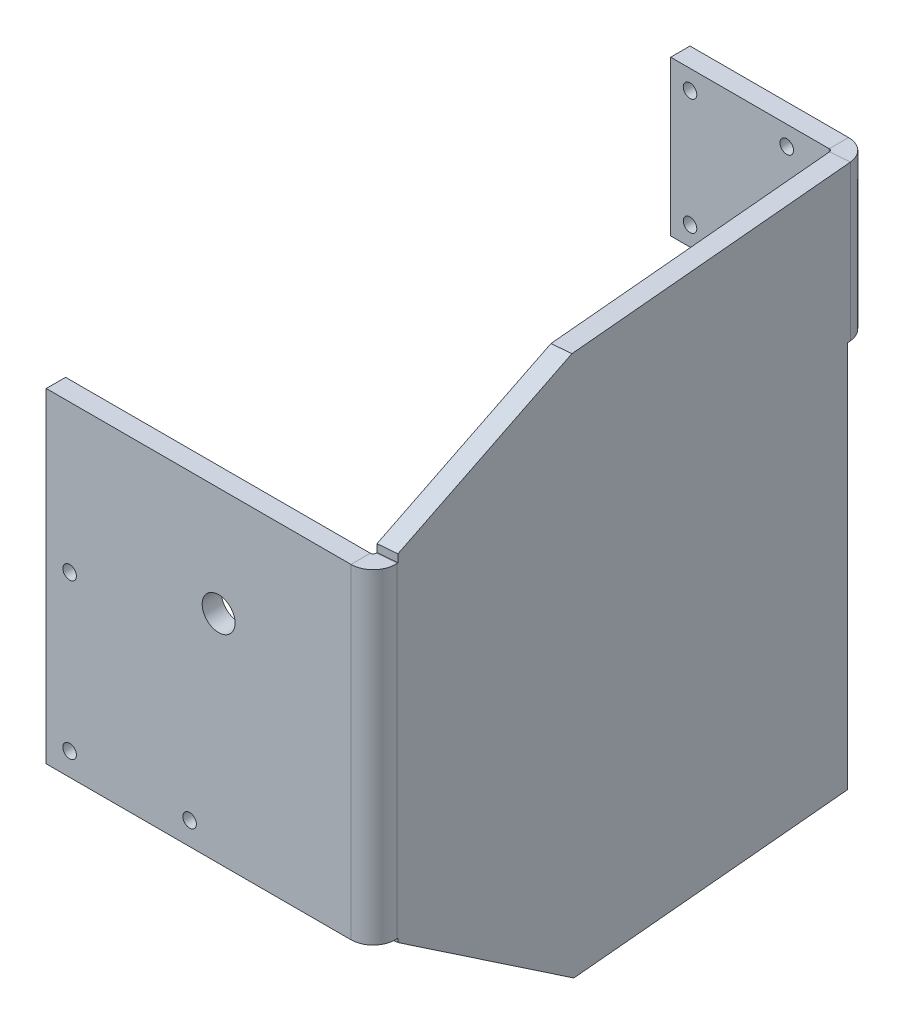
ISO-10303-21;
HEADER;
FILE_DESCRIPTION(('STEP AP214'),'2;1');
FILE_NAME('part.step','',(''),(''),'','','');
FILE_SCHEMA(('AUTOMOTIVE_DESIGN { 1 0 10303 214 1 1 1 1 }'));
ENDSEC;
DATA;
#1=APPLICATION_CONTEXT('core data for automotive mechanical design processes');
#2=APPLICATION_PROTOCOL_DEFINITION('international standard','automotive_design',2000,#1);
#3=PRODUCT_CONTEXT('',#1,'mechanical');
#4=PRODUCT('Part','Part','',(#3));
#5=PRODUCT_RELATED_PRODUCT_CATEGORY('part','',(#4));
#6=PRODUCT_DEFINITION_FORMATION('','',#4);
#7=PRODUCT_DEFINITION_CONTEXT('part definition',#1,'design');
#8=PRODUCT_DEFINITION('design','',#6,#7);
#9=PRODUCT_DEFINITION_SHAPE('','',#8);
#10=(LENGTH_UNIT() NAMED_UNIT(*) SI_UNIT(.MILLI.,.METRE.));
#11=(NAMED_UNIT(*) PLANE_ANGLE_UNIT() SI_UNIT($,.RADIAN.));
#12=(NAMED_UNIT(*) SI_UNIT($,.STERADIAN.) SOLID_ANGLE_UNIT());
#13=UNCERTAINTY_MEASURE_WITH_UNIT(LENGTH_MEASURE(1.E-05),#10,'distance_accuracy_value','');
#14=(GEOMETRIC_REPRESENTATION_CONTEXT(3) GLOBAL_UNCERTAINTY_ASSIGNED_CONTEXT((#13)) GLOBAL_UNIT_ASSIGNED_CONTEXT((#10,
#11,#12)) REPRESENTATION_CONTEXT('',''));
#15=CARTESIAN_POINT('',(0.,0.,0.));
#16=DIRECTION('',(0.,0.,1.));
#17=DIRECTION('',(1.,0.,0.));
#18=AXIS2_PLACEMENT_3D('',#15,#16,#17);
#19=CARTESIAN_POINT('',(56.2588254222091,0.,-5.36112372776498));
#20=DIRECTION('',(-0.996194698091745,0.,0.087155742747662));
#21=DIRECTION('',(0.087155742747662,0.,0.996194698091745));
#22=AXIS2_PLACEMENT_3D('',#19,#20,#21);
#23=PLANE('',#22);
#24=DIRECTION('',(0.087155742747662,0.,0.996194698091745));
#25=VECTOR('',#24,1.);
#26=CARTESIAN_POINT('',(58.4219175106389,140.,19.3631319786752));
#27=LINE('',#26,#25);
#28=CARTESIAN_POINT('',(53.5867336963334,140.,-35.9032719122991));
#29=VERTEX_POINT('',#28);
#30=CARTESIAN_POINT('',(46.6873684412418,140.,-114.763377633847));
#31=VERTEX_POINT('',#30);
#32=EDGE_CURVE('E268',#29,#31,#27,.F.);
#33=ORIENTED_EDGE('',*,*,#32,.F.);
#34=DIRECTION('',(-0.0818996083190929,0.34202014332567,-0.936116806662858));
#35=VECTOR('',#34,1.);
#36=CARTESIAN_POINT('',(53.5867336963334,140.,-35.9032719122991));
#37=LINE('',#36,#35);
#38=CARTESIAN_POINT('',(57.8969855294833,122.,13.3631319786756));
#39=VERTEX_POINT('',#38);
#40=EDGE_CURVE('E100',#29,#39,#37,.F.);
#41=ORIENTED_EDGE('',*,*,#40,.T.);
#42=DIRECTION('',(0.,1.,0.));
#43=VECTOR('',#42,1.);
#44=CARTESIAN_POINT('',(57.8969855294833,0.,13.3631319786756));
#45=LINE('',#44,#43);
#46=CARTESIAN_POINT('',(57.8969855294833,120.,13.3631319786756));
#47=VERTEX_POINT('',#46);
#48=EDGE_CURVE('E519',#47,#39,#45,.T.);
#49=ORIENTED_EDGE('',*,*,#48,.F.);
#50=DIRECTION('',(0.087155742747662,0.,0.996194698091745));
#51=VECTOR('',#50,1.);
#52=CARTESIAN_POINT('',(56.2588254222091,120.,-5.36112372776498));
#53=LINE('',#52,#51);
#54=CARTESIAN_POINT('',(57.914413365736,120.,13.5623330585672));
#55=VERTEX_POINT('',#54);
#56=EDGE_CURVE('E511',#47,#55,#53,.T.);
#57=ORIENTED_EDGE('',*,*,#56,.T.);
#58=DIRECTION('',(0.,1.,0.));
#59=VECTOR('',#58,1.);
#60=CARTESIAN_POINT('',(57.914413365736,140.,13.5623330585672));
#61=LINE('',#60,#59);
#62=CARTESIAN_POINT('',(57.914413365736,36.,13.5623330585673));
#63=VERTEX_POINT('',#62);
#64=EDGE_CURVE('E262',#55,#63,#61,.F.);
#65=ORIENTED_EDGE('',*,*,#64,.T.);
#66=DIRECTION('',(0.087155742747662,0.,0.996194698091745));
#67=VECTOR('',#66,1.);
#68=CARTESIAN_POINT('',(56.2588254222091,36.,-5.36112372776498));
#69=LINE('',#68,#67);
#70=CARTESIAN_POINT('',(57.8969855294833,36.,13.3631319786756));
#71=VERTEX_POINT('',#70);
#72=EDGE_CURVE('E484',#63,#71,#69,.F.);
#73=ORIENTED_EDGE('',*,*,#72,.T.);
#74=DIRECTION('',(0.,1.,0.));
#75=VECTOR('',#74,1.);
#76=CARTESIAN_POINT('',(57.8969855294833,0.,13.3631319786756));
#77=LINE('',#76,#75);
#78=CARTESIAN_POINT('',(57.8969855294833,35.0103769104855,13.3631319786756));
#79=VERTEX_POINT('',#78);
#80=EDGE_CURVE('E488',#71,#79,#77,.F.);
#81=ORIENTED_EDGE('',*,*,#80,.T.);
#82=DIRECTION('',(-0.0713938048432728,-0.573576436351044,-0.816034923451709));
#83=VECTOR('',#82,1.);
#84=CARTESIAN_POINT('',(57.8969855294833,35.0103769104855,13.3631319786756));
#85=LINE('',#84,#83);
#86=CARTESIAN_POINT('',(53.5391983921002,0.,-36.446602925912));
#87=VERTEX_POINT('',#86);
#88=EDGE_CURVE('E333',#79,#87,#85,.T.);
#89=ORIENTED_EDGE('',*,*,#88,.T.);
#90=DIRECTION('',(-0.087155742747662,0.,-0.996194698091745));
#91=VECTOR('',#90,1.);
#92=CARTESIAN_POINT('',(46.6285409694087,0.,-115.435778713739));
#93=LINE('',#92,#91);
#94=CARTESIAN_POINT('',(46.7541553301926,0.,-114.));
#95=VERTEX_POINT('',#94);
#96=EDGE_CURVE('E271',#95,#87,#93,.F.);
#97=ORIENTED_EDGE('',*,*,#96,.F.);
#98=DIRECTION('',(0.,1.,0.));
#99=VECTOR('',#98,1.);
#100=CARTESIAN_POINT('',(46.7541553301926,49.9999999999989,-114.));
#101=LINE('',#100,#99);
#102=CARTESIAN_POINT('',(46.7541553301926,99.9999999999978,-114.));
#103=VERTEX_POINT('',#102);
#104=EDGE_CURVE('E459',#103,#95,#101,.F.);
#105=ORIENTED_EDGE('',*,*,#104,.F.);
#106=DIRECTION('',(-0.087155742747662,0.,-0.996194698091745));
#107=VECTOR('',#106,1.);
#108=CARTESIAN_POINT('',(46.7207618857172,99.9999999999978,-114.381688816924));
#109=LINE('',#108,#107);
#110=CARTESIAN_POINT('',(46.6873684412418,99.9999999999978,-114.763377633847));
#111=VERTEX_POINT('',#110);
#112=EDGE_CURVE('E353',#111,#103,#109,.F.);
#113=ORIENTED_EDGE('',*,*,#112,.F.);
#114=DIRECTION('',(0.,1.,0.));
#115=VECTOR('',#114,1.);
#116=CARTESIAN_POINT('',(46.6873684412418,0.,-114.763377633847));
#117=LINE('',#116,#115);
#118=EDGE_CURVE('E279',#31,#111,#117,.F.);
#119=ORIENTED_EDGE('',*,*,#118,.F.);
#120=EDGE_LOOP('',(#33,#41,#49,#57,#65,#73,#81,#89,#97,#105,#113,#119));
#121=FACE_BOUND('',#120,.T.);
#122=ADVANCED_FACE('F78',(#121),#23,.F.);
#123=CARTESIAN_POINT('',(51.2778519317504,0.,-4.92534501402667));
#124=DIRECTION('',(-0.996194698091745,0.,0.087155742747662));
#125=DIRECTION('',(0.087155742747662,0.,0.996194698091745));
#126=AXIS2_PLACEMENT_3D('',#123,#124,#125);
#127=PLANE('',#126);
#128=DIRECTION('',(0.,1.,0.));
#129=VECTOR('',#128,1.);
#130=CARTESIAN_POINT('',(52.9160120390246,0.,13.7989106924139));
#131=LINE('',#130,#129);
#132=CARTESIAN_POINT('',(52.9160120390246,120.,13.7989106924134));
#133=VERTEX_POINT('',#132);
#134=CARTESIAN_POINT('',(52.9160120390246,122.,13.7989106924139));
#135=VERTEX_POINT('',#134);
#136=EDGE_CURVE('E374',#133,#135,#131,.T.);
#137=ORIENTED_EDGE('',*,*,#136,.T.);
#138=DIRECTION('',(0.0818996083190929,-0.34202014332567,0.936116806662858));
#139=VECTOR('',#138,1.);
#140=CARTESIAN_POINT('',(54.8868607864539,113.769558061344,36.3258149563615));
#141=LINE('',#140,#139);
#142=CARTESIAN_POINT('',(48.6057602058747,140.,-35.4674931985608));
#143=VERTEX_POINT('',#142);
#144=EDGE_CURVE('E13',#135,#143,#141,.F.);
#145=ORIENTED_EDGE('',*,*,#144,.T.);
#146=DIRECTION('',(-0.087155742747662,0.,-0.996194698091745));
#147=VECTOR('',#146,1.);
#148=CARTESIAN_POINT('',(51.2778519317504,140.,-4.9253450140267));
#149=LINE('',#148,#147);
#150=CARTESIAN_POINT('',(41.7063949507831,140.,-114.327598920108));
#151=VERTEX_POINT('',#150);
#152=EDGE_CURVE('E274',#143,#151,#149,.T.);
#153=ORIENTED_EDGE('',*,*,#152,.T.);
#154=DIRECTION('',(0.,1.,0.));
#155=VECTOR('',#154,1.);
#156=CARTESIAN_POINT('',(41.7063949507831,0.,-114.327598920108));
#157=LINE('',#156,#155);
#158=CARTESIAN_POINT('',(41.7063949507831,99.9999999999978,-114.327598920108));
#159=VERTEX_POINT('',#158);
#160=EDGE_CURVE('E264',#159,#151,#157,.T.);
#161=ORIENTED_EDGE('',*,*,#160,.F.);
#162=DIRECTION('',(0.087155742747662,0.,0.996194698091745));
#163=VECTOR('',#162,1.);
#164=CARTESIAN_POINT('',(51.2778519317504,99.9999999999978,-4.92534501402667));
#165=LINE('',#164,#163);
#166=CARTESIAN_POINT('',(41.7731818397339,99.9999999999978,-113.564221286262));
#167=VERTEX_POINT('',#166);
#168=EDGE_CURVE('E372',#159,#167,#165,.T.);
#169=ORIENTED_EDGE('',*,*,#168,.T.);
#170=DIRECTION('',(0.,-1.,0.));
#171=VECTOR('',#170,1.);
#172=CARTESIAN_POINT('',(41.7731818397339,0.,-113.564221286262));
#173=LINE('',#172,#171);
#174=CARTESIAN_POINT('',(41.7731818397339,0.,-113.564221286262));
#175=VERTEX_POINT('',#174);
#176=EDGE_CURVE('E458',#167,#175,#173,.T.);
#177=ORIENTED_EDGE('',*,*,#176,.T.);
#178=DIRECTION('',(0.087155742747662,0.,0.996194698091745));
#179=VECTOR('',#178,1.);
#180=CARTESIAN_POINT('',(51.2778519317504,0.,-4.92534501402667));
#181=LINE('',#180,#179);
#182=CARTESIAN_POINT('',(48.5582249016415,0.,-36.0108242121737));
#183=VERTEX_POINT('',#182);
#184=EDGE_CURVE('E276',#175,#183,#181,.T.);
#185=ORIENTED_EDGE('',*,*,#184,.T.);
#186=DIRECTION('',(0.0713938048432728,0.573576436351044,0.816034923451709));
#187=VECTOR('',#186,1.);
#188=CARTESIAN_POINT('',(50.3831220300111,14.661187954547,-15.1521545877514));
#189=LINE('',#188,#187);
#190=CARTESIAN_POINT('',(52.9160120390246,35.0103769104855,13.7989106924139));
#191=VERTEX_POINT('',#190);
#192=EDGE_CURVE('E337',#183,#191,#189,.T.);
#193=ORIENTED_EDGE('',*,*,#192,.T.);
#194=DIRECTION('',(0.,-1.,0.));
#195=VECTOR('',#194,1.);
#196=CARTESIAN_POINT('',(52.9160120390246,0.,13.7989106924139));
#197=LINE('',#196,#195);
#198=CARTESIAN_POINT('',(52.9160120390246,36.,13.7989106924139));
#199=VERTEX_POINT('',#198);
#200=EDGE_CURVE('E477',#199,#191,#197,.T.);
#201=ORIENTED_EDGE('',*,*,#200,.F.);
#202=DIRECTION('',(-0.087155742747662,0.,-0.996194698091745));
#203=VECTOR('',#202,1.);
#204=CARTESIAN_POINT('',(51.2778519317504,36.,-4.92534501402667));
#205=LINE('',#204,#203);
#206=CARTESIAN_POINT('',(52.9334398752773,36.,13.9981117723056));
#207=VERTEX_POINT('',#206);
#208=EDGE_CURVE('E485',#207,#199,#205,.T.);
#209=ORIENTED_EDGE('',*,*,#208,.F.);
#210=DIRECTION('',(0.,1.,0.));
#211=VECTOR('',#210,1.);
#212=CARTESIAN_POINT('',(52.9334398752773,140.,13.9981117723056));
#213=LINE('',#212,#211);
#214=CARTESIAN_POINT('',(52.9334398752773,120.,13.9981117723056));
#215=VERTEX_POINT('',#214);
#216=EDGE_CURVE('E265',#215,#207,#213,.F.);
#217=ORIENTED_EDGE('',*,*,#216,.F.);
#218=DIRECTION('',(0.087155742747662,0.,0.996194698091745));
#219=VECTOR('',#218,1.);
#220=CARTESIAN_POINT('',(51.2778519317504,120.,-4.92534501402667));
#221=LINE('',#220,#219);
#222=EDGE_CURVE('E516',#133,#215,#221,.T.);
#223=ORIENTED_EDGE('',*,*,#222,.F.);
#224=EDGE_LOOP('',(#137,#145,#153,#161,#169,#177,#185,#193,#201,#209,#217,#223));
#225=FACE_BOUND('',#224,.T.);
#226=ADVANCED_FACE('F370',(#225),#127,.T.);
#227=CARTESIAN_POINT('',(46.6285409694087,0.,-115.435778713739));
#228=DIRECTION('',(0.,-1.,0.));
#229=DIRECTION('',(1.,0.,0.));
#230=AXIS2_PLACEMENT_3D('',#227,#228,#229);
#231=PLANE('',#230);
#232=ORIENTED_EDGE('',*,*,#96,.T.);
#233=DIRECTION('',(-0.996194698091745,0.,0.087155742747662));
#234=VECTOR('',#233,1.);
#235=CARTESIAN_POINT('',(53.5391983921002,0.,-36.446602925912));
#236=LINE('',#235,#234);
#237=EDGE_CURVE('E335',#87,#183,#236,.T.);
#238=ORIENTED_EDGE('',*,*,#237,.T.);
#239=ORIENTED_EDGE('',*,*,#184,.F.);
#240=DIRECTION('',(0.996194698091745,0.,-0.087155742747662));
#241=VECTOR('',#240,1.);
#242=CARTESIAN_POINT('',(41.7731818397339,0.,-113.564221286262));
#243=LINE('',#242,#241);
#244=EDGE_CURVE('E461',#95,#175,#243,.F.);
#245=ORIENTED_EDGE('',*,*,#244,.F.);
#246=EDGE_LOOP('',(#232,#238,#239,#245));
#247=FACE_BOUND('',#246,.T.);
#248=ADVANCED_FACE('F387',(#247),#231,.T.);
#249=CARTESIAN_POINT('',(58.4219175106388,140.,19.3631319786752));
#250=DIRECTION('',(0.,1.,0.));
#251=DIRECTION('',(0.,0.,1.));
#252=AXIS2_PLACEMENT_3D('',#249,#250,#251);
#253=PLANE('',#252);
#254=ORIENTED_EDGE('',*,*,#152,.F.);
#255=DIRECTION('',(0.996194698091745,0.,-0.087155742747662));
#256=VECTOR('',#255,1.);
#257=CARTESIAN_POINT('',(53.5867336963334,140.,-35.9032719122991));
#258=LINE('',#257,#256);
#259=EDGE_CURVE('E339',#143,#29,#258,.T.);
#260=ORIENTED_EDGE('',*,*,#259,.T.);
#261=ORIENTED_EDGE('',*,*,#32,.T.);
#262=DIRECTION('',(0.996194698091745,0.,-0.087155742747662));
#263=VECTOR('',#262,1.);
#264=CARTESIAN_POINT('',(41.7063949507831,140.,-114.327598920108));
#265=LINE('',#264,#263);
#266=EDGE_CURVE('E282',#151,#31,#265,.T.);
#267=ORIENTED_EDGE('',*,*,#266,.F.);
#268=EDGE_LOOP('',(#254,#260,#261,#267));
#269=FACE_BOUND('',#268,.T.);
#270=ADVANCED_FACE('F345',(#269),#253,.T.);
#271=CARTESIAN_POINT('',(52.1996428606629,140.,14.0623106924135));
#272=DIRECTION('',(0.,1.,0.));
#273=DIRECTION('',(0.,0.,1.));
#274=AXIS2_PLACEMENT_3D('',#271,#272,#273);
#275=CYLINDRICAL_SURFACE('',#274,5.7366);
#276=ORIENTED_EDGE('',*,*,#64,.F.);
#277=CARTESIAN_POINT('',(52.1996428606629,120.,14.0623106924135));
#278=DIRECTION('',(0.,1.,0.));
#279=DIRECTION('',(0.,0.,1.));
#280=AXIS2_PLACEMENT_3D('',#277,#278,#279);
#281=CIRCLE('',#280,5.7366);
#282=CARTESIAN_POINT('',(52.1996428606629,120.,19.7989106924139));
#283=VERTEX_POINT('',#282);
#284=EDGE_CURVE('E251',#283,#55,#281,.T.);
#285=ORIENTED_EDGE('',*,*,#284,.F.);
#286=DIRECTION('',(0.,1.,0.));
#287=VECTOR('',#286,1.);
#288=CARTESIAN_POINT('',(52.1996428606629,0.,19.7989106924135));
#289=LINE('',#288,#287);
#290=CARTESIAN_POINT('',(52.1996428606629,36.,19.7989106924135));
#291=VERTEX_POINT('',#290);
#292=EDGE_CURVE('E243',#283,#291,#289,.F.);
#293=ORIENTED_EDGE('',*,*,#292,.T.);
#294=CARTESIAN_POINT('',(52.1996428606629,36.,14.0623106924135));
#295=DIRECTION('',(0.,1.,0.));
#296=DIRECTION('',(0.,0.,1.));
#297=AXIS2_PLACEMENT_3D('',#294,#295,#296);
#298=CIRCLE('',#297,5.7366);
#299=EDGE_CURVE('E216',#63,#291,#298,.F.);
#300=ORIENTED_EDGE('',*,*,#299,.F.);
#301=EDGE_LOOP('',(#276,#285,#293,#300));
#302=FACE_BOUND('',#301,.T.);
#303=ADVANCED_FACE('F249',(#302),#275,.T.);
#304=CARTESIAN_POINT('',(52.1996428606629,140.,14.0623106924135));
#305=DIRECTION('',(0.,1.,0.));
#306=DIRECTION('',(0.,0.,1.));
#307=AXIS2_PLACEMENT_3D('',#304,#305,#306);
#308=CYLINDRICAL_SURFACE('',#307,0.736600000000002);
#309=CARTESIAN_POINT('',(52.1996428606629,120.,14.0623106924135));
#310=DIRECTION('',(0.,1.,0.));
#311=DIRECTION('',(0.,0.,1.));
#312=AXIS2_PLACEMENT_3D('',#309,#310,#311);
#313=CIRCLE('',#312,0.736600000000001);
#314=CARTESIAN_POINT('',(52.1996428606629,120.,14.7989106924135));
#315=VERTEX_POINT('',#314);
#316=EDGE_CURVE('E505',#315,#215,#313,.T.);
#317=ORIENTED_EDGE('',*,*,#316,.T.);
#318=ORIENTED_EDGE('',*,*,#216,.T.);
#319=CARTESIAN_POINT('',(52.1996428606629,36.,14.0623106924135));
#320=DIRECTION('',(0.,-1.,0.));
#321=DIRECTION('',(0.,0.,-1.));
#322=AXIS2_PLACEMENT_3D('',#319,#320,#321);
#323=CIRCLE('',#322,0.736600000000001);
#324=CARTESIAN_POINT('',(52.1996428606629,36.,14.7989106924135));
#325=VERTEX_POINT('',#324);
#326=EDGE_CURVE('E236',#207,#325,#323,.T.);
#327=ORIENTED_EDGE('',*,*,#326,.T.);
#328=DIRECTION('',(0.,1.,0.));
#329=VECTOR('',#328,1.);
#330=CARTESIAN_POINT('',(52.1996428606629,0.,14.7989106924135));
#331=LINE('',#330,#329);
#332=EDGE_CURVE('E253',#325,#315,#331,.T.);
#333=ORIENTED_EDGE('',*,*,#332,.T.);
#334=EDGE_LOOP('',(#317,#318,#327,#333));
#335=FACE_BOUND('',#334,.T.);
#336=ADVANCED_FACE('F390',(#335),#308,.F.);
#337=CARTESIAN_POINT('',(-0.437443317629461,0.,19.7989106924139));
#338=DIRECTION('',(0.,0.,-1.));
#339=DIRECTION('',(-1.,0.,0.));
#340=AXIS2_PLACEMENT_3D('',#337,#338,#339);
#341=PLANE('',#340);
#342=CARTESIAN_POINT('',(18.0000197549396,91.8937258404988,19.7989106924137));
#343=DIRECTION('',(0.,0.,-1.));
#344=DIRECTION('',(-1.,0.,0.));
#345=AXIS2_PLACEMENT_3D('',#342,#343,#344);
#346=CIRCLE('',#345,4.25);
#347=CARTESIAN_POINT('',(13.7500197549396,91.8937258404988,19.7989106924138));
#348=VERTEX_POINT('',#347);
#349=EDGE_CURVE('E330',#348,#348,#346,.T.);
#350=ORIENTED_EDGE('',*,*,#349,.T.);
#351=EDGE_LOOP('',(#350));
#352=FACE_BOUND('',#351,.T.);
#353=CARTESIAN_POINT('',(-20.4999682175418,81.8944342916237,19.798910692414));
#354=DIRECTION('',(0.,0.,-1.));
#355=DIRECTION('',(-1.,0.,0.));
#356=AXIS2_PLACEMENT_3D('',#353,#354,#355);
#357=CIRCLE('',#356,1.75);
#358=CARTESIAN_POINT('',(-22.2499682175418,81.8944342916237,19.798910692414));
#359=VERTEX_POINT('',#358);
#360=EDGE_CURVE('E326',#359,#359,#357,.T.);
#361=ORIENTED_EDGE('',*,*,#360,.T.);
#362=EDGE_LOOP('',(#361));
#363=FACE_BOUND('',#362,.T.);
#364=CARTESIAN_POINT('',(10.5000087800418,41.8964274868236,19.7989106924138));
#365=DIRECTION('',(0.,0.,-1.));
#366=DIRECTION('',(-1.,0.,0.));
#367=AXIS2_PLACEMENT_3D('',#364,#365,#366);
#368=CIRCLE('',#367,1.75);
#369=CARTESIAN_POINT('',(8.75000878004175,41.8964274868236,19.7989106924138));
#370=VERTEX_POINT('',#369);
#371=EDGE_CURVE('E322',#370,#370,#368,.T.);
#372=ORIENTED_EDGE('',*,*,#371,.T.);
#373=EDGE_LOOP('',(#372));
#374=FACE_BOUND('',#373,.T.);
#375=CARTESIAN_POINT('',(-20.4999722566747,41.8964342916236,19.798910692414));
#376=DIRECTION('',(0.,0.,-1.));
#377=DIRECTION('',(-1.,0.,0.));
#378=AXIS2_PLACEMENT_3D('',#375,#376,#377);
#379=CIRCLE('',#378,1.75);
#380=CARTESIAN_POINT('',(-22.2499722566747,41.8964342916236,19.798910692414));
#381=VERTEX_POINT('',#380);
#382=EDGE_CURVE('E317',#381,#381,#379,.T.);
#383=ORIENTED_EDGE('',*,*,#382,.T.);
#384=EDGE_LOOP('',(#383));
#385=FACE_BOUND('',#384,.T.);
#386=DIRECTION('',(1.,0.,0.));
#387=VECTOR('',#386,1.);
#388=CARTESIAN_POINT('',(-26.5399567921031,120.,19.7989106924139));
#389=LINE('',#388,#387);
#390=CARTESIAN_POINT('',(-26.5399567921031,120.,19.7989106924141));
#391=VERTEX_POINT('',#390);
#392=EDGE_CURVE('E499',#391,#283,#389,.T.);
#393=ORIENTED_EDGE('',*,*,#392,.F.);
#394=DIRECTION('',(0.,-1.,0.));
#395=VECTOR('',#394,1.);
#396=CARTESIAN_POINT('',(-26.5399567921031,0.,19.7989106924141));
#397=LINE('',#396,#395);
#398=CARTESIAN_POINT('',(-26.5399567921031,36.,19.7989106924141));
#399=VERTEX_POINT('',#398);
#400=EDGE_CURVE('E245',#391,#399,#397,.T.);
#401=ORIENTED_EDGE('',*,*,#400,.T.);
#402=DIRECTION('',(1.,0.,0.));
#403=VECTOR('',#402,1.);
#404=CARTESIAN_POINT('',(-0.437443317629463,36.,19.7989106924139));
#405=LINE('',#404,#403);
#406=EDGE_CURVE('E231',#399,#291,#405,.T.);
#407=ORIENTED_EDGE('',*,*,#406,.T.);
#408=ORIENTED_EDGE('',*,*,#292,.F.);
#409=EDGE_LOOP('',(#393,#401,#407,#408));
#410=FACE_BOUND('',#409,.T.);
#411=ADVANCED_FACE('F242',(#352,#363,#374,#385,#410),#341,.F.);
#412=CARTESIAN_POINT('',(-0.437443317629497,0.,14.7989106924139));
#413=DIRECTION('',(0.,0.,-1.));
#414=DIRECTION('',(-1.,0.,0.));
#415=AXIS2_PLACEMENT_3D('',#412,#413,#414);
#416=PLANE('',#415);
#417=CARTESIAN_POINT('',(18.0000197549396,91.8937258404988,14.7989106924137));
#418=DIRECTION('',(0.,0.,-1.));
#419=DIRECTION('',(-1.,0.,0.));
#420=AXIS2_PLACEMENT_3D('',#417,#418,#419);
#421=CIRCLE('',#420,4.25);
#422=CARTESIAN_POINT('',(13.7500197549396,91.8937258404988,14.7989106924138));
#423=VERTEX_POINT('',#422);
#424=EDGE_CURVE('E327',#423,#423,#421,.T.);
#425=ORIENTED_EDGE('',*,*,#424,.F.);
#426=EDGE_LOOP('',(#425));
#427=FACE_BOUND('',#426,.T.);
#428=CARTESIAN_POINT('',(-20.4999682175418,81.8944342916237,14.798910692414));
#429=DIRECTION('',(0.,0.,-1.));
#430=DIRECTION('',(-1.,0.,0.));
#431=AXIS2_PLACEMENT_3D('',#428,#429,#430);
#432=CIRCLE('',#431,1.75);
#433=CARTESIAN_POINT('',(-22.2499682175418,81.8944342916237,14.798910692414));
#434=VERTEX_POINT('',#433);
#435=EDGE_CURVE('E323',#434,#434,#432,.T.);
#436=ORIENTED_EDGE('',*,*,#435,.F.);
#437=EDGE_LOOP('',(#436));
#438=FACE_BOUND('',#437,.T.);
#439=CARTESIAN_POINT('',(10.5000087800418,41.8964274868236,14.7989106924138));
#440=DIRECTION('',(0.,0.,-1.));
#441=DIRECTION('',(-1.,0.,0.));
#442=AXIS2_PLACEMENT_3D('',#439,#440,#441);
#443=CIRCLE('',#442,1.75);
#444=CARTESIAN_POINT('',(8.75000878004175,41.8964274868236,14.7989106924138));
#445=VERTEX_POINT('',#444);
#446=EDGE_CURVE('E319',#445,#445,#443,.T.);
#447=ORIENTED_EDGE('',*,*,#446,.F.);
#448=EDGE_LOOP('',(#447));
#449=FACE_BOUND('',#448,.T.);
#450=CARTESIAN_POINT('',(-20.4999722566747,41.8964342916236,14.798910692414));
#451=DIRECTION('',(0.,0.,-1.));
#452=DIRECTION('',(-1.,0.,0.));
#453=AXIS2_PLACEMENT_3D('',#450,#451,#452);
#454=CIRCLE('',#453,1.75);
#455=CARTESIAN_POINT('',(-22.2499722566747,41.8964342916236,14.798910692414));
#456=VERTEX_POINT('',#455);
#457=EDGE_CURVE('E314',#456,#456,#454,.T.);
#458=ORIENTED_EDGE('',*,*,#457,.F.);
#459=EDGE_LOOP('',(#458));
#460=FACE_BOUND('',#459,.T.);
#461=DIRECTION('',(0.,1.,0.));
#462=VECTOR('',#461,1.);
#463=CARTESIAN_POINT('',(-26.5399567921032,0.,14.7989106924141));
#464=LINE('',#463,#462);
#465=CARTESIAN_POINT('',(-26.5399567921032,120.,14.7989106924141));
#466=VERTEX_POINT('',#465);
#467=CARTESIAN_POINT('',(-26.5399567921032,36.,14.7989106924141));
#468=VERTEX_POINT('',#467);
#469=EDGE_CURVE('E252',#466,#468,#464,.F.);
#470=ORIENTED_EDGE('',*,*,#469,.F.);
#471=DIRECTION('',(-1.,0.,0.));
#472=VECTOR('',#471,1.);
#473=CARTESIAN_POINT('',(-0.437443317629488,120.,14.7989106924139));
#474=LINE('',#473,#472);
#475=EDGE_CURVE('E496',#466,#315,#474,.F.);
#476=ORIENTED_EDGE('',*,*,#475,.T.);
#477=ORIENTED_EDGE('',*,*,#332,.F.);
#478=DIRECTION('',(-1.,0.,0.));
#479=VECTOR('',#478,1.);
#480=CARTESIAN_POINT('',(12.8298430342799,36.,14.7989106924138));
#481=LINE('',#480,#479);
#482=EDGE_CURVE('E234',#468,#325,#481,.F.);
#483=ORIENTED_EDGE('',*,*,#482,.F.);
#484=EDGE_LOOP('',(#470,#476,#477,#483));
#485=FACE_BOUND('',#484,.T.);
#486=ADVANCED_FACE('F626',(#427,#438,#449,#460,#485),#416,.T.);
#487=CARTESIAN_POINT('',(-26.5399567921031,0.,19.7989106924141));
#488=DIRECTION('',(1.,0.,0.));
#489=DIRECTION('',(0.,0.,-1.));
#490=AXIS2_PLACEMENT_3D('',#487,#488,#489);
#491=PLANE('',#490);
#492=DIRECTION('',(0.,0.,1.));
#493=VECTOR('',#492,1.);
#494=CARTESIAN_POINT('',(-26.5399567921031,120.,19.7989106924141));
#495=LINE('',#494,#493);
#496=EDGE_CURVE('E502',#391,#466,#495,.F.);
#497=ORIENTED_EDGE('',*,*,#496,.T.);
#498=ORIENTED_EDGE('',*,*,#469,.T.);
#499=DIRECTION('',(0.,0.,-1.));
#500=VECTOR('',#499,1.);
#501=CARTESIAN_POINT('',(-26.5399567921031,36.,19.7989106924141));
#502=LINE('',#501,#500);
#503=EDGE_CURVE('E246',#468,#399,#502,.F.);
#504=ORIENTED_EDGE('',*,*,#503,.T.);
#505=ORIENTED_EDGE('',*,*,#400,.F.);
#506=EDGE_LOOP('',(#497,#498,#504,#505));
#507=FACE_BOUND('',#506,.T.);
#508=ADVANCED_FACE('F411',(#507),#491,.F.);
#509=CARTESIAN_POINT('',(0.,0.,-115.));
#510=DIRECTION('',(0.,0.,1.));
#511=DIRECTION('',(1.,0.,0.));
#512=AXIS2_PLACEMENT_3D('',#509,#510,#511);
#513=PLANE('',#512);
#514=CARTESIAN_POINT('',(30.,135.,-115.));
#515=DIRECTION('',(0.,0.,1.));
#516=DIRECTION('',(1.,0.,0.));
#517=AXIS2_PLACEMENT_3D('',#514,#515,#516);
#518=CIRCLE('',#517,1.75);
#519=CARTESIAN_POINT('',(31.75,135.,-115.));
#520=VERTEX_POINT('',#519);
#521=EDGE_CURVE('E318',#520,#520,#518,.T.);
#522=ORIENTED_EDGE('',*,*,#521,.F.);
#523=EDGE_LOOP('',(#522));
#524=FACE_BOUND('',#523,.T.);
#525=CARTESIAN_POINT('',(30.,105.,-115.));
#526=DIRECTION('',(0.,0.,1.));
#527=DIRECTION('',(1.,0.,0.));
#528=AXIS2_PLACEMENT_3D('',#525,#526,#527);
#529=CIRCLE('',#528,1.75);
#530=CARTESIAN_POINT('',(31.75,105.,-115.));
#531=VERTEX_POINT('',#530);
#532=EDGE_CURVE('E536',#531,#531,#529,.T.);
#533=ORIENTED_EDGE('',*,*,#532,.F.);
#534=EDGE_LOOP('',(#533));
#535=FACE_BOUND('',#534,.T.);
#536=CARTESIAN_POINT('',(5.,105.,-115.));
#537=DIRECTION('',(0.,0.,1.));
#538=DIRECTION('',(1.,0.,0.));
#539=AXIS2_PLACEMENT_3D('',#536,#537,#538);
#540=CIRCLE('',#539,1.75);
#541=CARTESIAN_POINT('',(6.75,105.,-115.));
#542=VERTEX_POINT('',#541);
#543=EDGE_CURVE('E539',#542,#542,#540,.T.);
#544=ORIENTED_EDGE('',*,*,#543,.F.);
#545=EDGE_LOOP('',(#544));
#546=FACE_BOUND('',#545,.T.);
#547=CARTESIAN_POINT('',(5.,135.,-115.));
#548=DIRECTION('',(0.,0.,1.));
#549=DIRECTION('',(1.,0.,0.));
#550=AXIS2_PLACEMENT_3D('',#547,#548,#549);
#551=CIRCLE('',#550,1.75);
#552=CARTESIAN_POINT('',(6.75,135.,-115.));
#553=VERTEX_POINT('',#552);
#554=EDGE_CURVE('E542',#553,#553,#551,.T.);
#555=ORIENTED_EDGE('',*,*,#554,.F.);
#556=EDGE_LOOP('',(#555));
#557=FACE_BOUND('',#556,.T.);
#558=DIRECTION('',(0.,-1.,0.));
#559=VECTOR('',#558,1.);
#560=CARTESIAN_POINT('',(0.,140.,-115.));
#561=LINE('',#560,#559);
#562=CARTESIAN_POINT('',(0.,140.,-115.));
#563=VERTEX_POINT('',#562);
#564=CARTESIAN_POINT('',(0.,99.9999999999978,-115.));
#565=VERTEX_POINT('',#564);
#566=EDGE_CURVE('E301',#563,#565,#561,.T.);
#567=ORIENTED_EDGE('',*,*,#566,.T.);
#568=DIRECTION('',(1.,0.,0.));
#569=VECTOR('',#568,1.);
#570=CARTESIAN_POINT('',(0.,99.9999999999978,-115.));
#571=LINE('',#570,#569);
#572=CARTESIAN_POINT('',(40.9725979361687,99.9999999999978,-115.));
#573=VERTEX_POINT('',#572);
#574=EDGE_CURVE('E429',#565,#573,#571,.T.);
#575=ORIENTED_EDGE('',*,*,#574,.T.);
#576=DIRECTION('',(0.,1.,0.));
#577=VECTOR('',#576,1.);
#578=CARTESIAN_POINT('',(40.9725979361687,140.,-115.));
#579=LINE('',#578,#577);
#580=CARTESIAN_POINT('',(40.9725979361687,140.,-115.));
#581=VERTEX_POINT('',#580);
#582=EDGE_CURVE('E294',#581,#573,#579,.F.);
#583=ORIENTED_EDGE('',*,*,#582,.F.);
#584=DIRECTION('',(-1.,0.,0.));
#585=VECTOR('',#584,1.);
#586=CARTESIAN_POINT('',(0.,140.,-115.));
#587=LINE('',#586,#585);
#588=EDGE_CURVE('E304',#581,#563,#587,.T.);
#589=ORIENTED_EDGE('',*,*,#588,.T.);
#590=EDGE_LOOP('',(#567,#575,#583,#589));
#591=FACE_BOUND('',#590,.T.);
#592=ADVANCED_FACE('F407',(#524,#535,#546,#557,#591),#513,.T.);
#593=CARTESIAN_POINT('',(0.,0.,-120.));
#594=DIRECTION('',(0.,0.,1.));
#595=DIRECTION('',(1.,0.,0.));
#596=AXIS2_PLACEMENT_3D('',#593,#594,#595);
#597=PLANE('',#596);
#598=CARTESIAN_POINT('',(30.,135.,-120.));
#599=DIRECTION('',(0.,0.,-1.));
#600=DIRECTION('',(-1.,0.,0.));
#601=AXIS2_PLACEMENT_3D('',#598,#599,#600);
#602=CIRCLE('',#601,1.75);
#603=CARTESIAN_POINT('',(28.25,135.,-120.));
#604=VERTEX_POINT('',#603);
#605=EDGE_CURVE('E549',#604,#604,#602,.T.);
#606=ORIENTED_EDGE('',*,*,#605,.F.);
#607=EDGE_LOOP('',(#606));
#608=FACE_BOUND('',#607,.T.);
#609=CARTESIAN_POINT('',(30.,105.,-120.));
#610=DIRECTION('',(0.,0.,-1.));
#611=DIRECTION('',(-1.,0.,0.));
#612=AXIS2_PLACEMENT_3D('',#609,#610,#611);
#613=CIRCLE('',#612,1.75);
#614=CARTESIAN_POINT('',(28.25,105.,-120.));
#615=VERTEX_POINT('',#614);
#616=EDGE_CURVE('E552',#615,#615,#613,.T.);
#617=ORIENTED_EDGE('',*,*,#616,.F.);
#618=EDGE_LOOP('',(#617));
#619=FACE_BOUND('',#618,.T.);
#620=CARTESIAN_POINT('',(5.,105.,-120.));
#621=DIRECTION('',(0.,0.,-1.));
#622=DIRECTION('',(-1.,0.,0.));
#623=AXIS2_PLACEMENT_3D('',#620,#621,#622);
#624=CIRCLE('',#623,1.75);
#625=CARTESIAN_POINT('',(3.24999999999999,105.,-120.));
#626=VERTEX_POINT('',#625);
#627=EDGE_CURVE('E548',#626,#626,#624,.T.);
#628=ORIENTED_EDGE('',*,*,#627,.F.);
#629=EDGE_LOOP('',(#628));
#630=FACE_BOUND('',#629,.T.);
#631=CARTESIAN_POINT('',(5.,135.,-120.));
#632=DIRECTION('',(0.,0.,-1.));
#633=DIRECTION('',(-1.,0.,0.));
#634=AXIS2_PLACEMENT_3D('',#631,#632,#633);
#635=CIRCLE('',#634,1.75);
#636=CARTESIAN_POINT('',(3.25,135.,-120.));
#637=VERTEX_POINT('',#636);
#638=EDGE_CURVE('E545',#637,#637,#635,.T.);
#639=ORIENTED_EDGE('',*,*,#638,.F.);
#640=EDGE_LOOP('',(#639));
#641=FACE_BOUND('',#640,.T.);
#642=DIRECTION('',(-1.,0.,0.));
#643=VECTOR('',#642,1.);
#644=CARTESIAN_POINT('',(20.4862989680843,99.9999999999978,-120.));
#645=LINE('',#644,#643);
#646=CARTESIAN_POINT('',(0.,99.9999999999978,-120.));
#647=VERTEX_POINT('',#646);
#648=CARTESIAN_POINT('',(40.9725979361687,99.9999999999978,-120.));
#649=VERTEX_POINT('',#648);
#650=EDGE_CURVE('E437',#647,#649,#645,.F.);
#651=ORIENTED_EDGE('',*,*,#650,.F.);
#652=DIRECTION('',(0.,-1.,0.));
#653=VECTOR('',#652,1.);
#654=CARTESIAN_POINT('',(0.,140.,-120.));
#655=LINE('',#654,#653);
#656=CARTESIAN_POINT('',(0.,140.,-120.));
#657=VERTEX_POINT('',#656);
#658=EDGE_CURVE('E300',#657,#647,#655,.T.);
#659=ORIENTED_EDGE('',*,*,#658,.F.);
#660=DIRECTION('',(-1.,0.,0.));
#661=VECTOR('',#660,1.);
#662=CARTESIAN_POINT('',(0.,140.,-120.));
#663=LINE('',#662,#661);
#664=CARTESIAN_POINT('',(40.9725979361686,140.,-120.));
#665=VERTEX_POINT('',#664);
#666=EDGE_CURVE('E305',#665,#657,#663,.T.);
#667=ORIENTED_EDGE('',*,*,#666,.F.);
#668=DIRECTION('',(0.,1.,0.));
#669=VECTOR('',#668,1.);
#670=CARTESIAN_POINT('',(40.9725979361686,140.,-120.));
#671=LINE('',#670,#669);
#672=EDGE_CURVE('E287',#665,#649,#671,.F.);
#673=ORIENTED_EDGE('',*,*,#672,.T.);
#674=EDGE_LOOP('',(#651,#659,#667,#673));
#675=FACE_BOUND('',#674,.T.);
#676=ADVANCED_FACE('F410',(#608,#619,#630,#641,#675),#597,.F.);
#677=CARTESIAN_POINT('',(0.,140.,-115.));
#678=DIRECTION('',(1.,0.,0.));
#679=DIRECTION('',(0.,0.,-1.));
#680=AXIS2_PLACEMENT_3D('',#677,#678,#679);
#681=PLANE('',#680);
#682=DIRECTION('',(0.,0.,-1.));
#683=VECTOR('',#682,1.);
#684=CARTESIAN_POINT('',(0.,99.9999999999978,-115.));
#685=LINE('',#684,#683);
#686=EDGE_CURVE('E425',#647,#565,#685,.F.);
#687=ORIENTED_EDGE('',*,*,#686,.T.);
#688=ORIENTED_EDGE('',*,*,#566,.F.);
#689=DIRECTION('',(0.,0.,-1.));
#690=VECTOR('',#689,1.);
#691=CARTESIAN_POINT('',(0.,140.,-115.));
#692=LINE('',#691,#690);
#693=EDGE_CURVE('E307',#563,#657,#692,.T.);
#694=ORIENTED_EDGE('',*,*,#693,.T.);
#695=ORIENTED_EDGE('',*,*,#658,.T.);
#696=EDGE_LOOP('',(#687,#688,#694,#695));
#697=FACE_BOUND('',#696,.T.);
#698=ADVANCED_FACE('F400',(#697),#681,.F.);
#699=CARTESIAN_POINT('',(40.9725979361687,140.,-114.2634));
#700=DIRECTION('',(0.,1.,0.));
#701=DIRECTION('',(0.996194698091745,0.,-0.087155742747662));
#702=AXIS2_PLACEMENT_3D('',#699,#700,#701);
#703=CYLINDRICAL_SURFACE('',#702,5.73660000000001);
#704=ORIENTED_EDGE('',*,*,#118,.T.);
#705=CARTESIAN_POINT('',(40.9725979361687,99.9999999999978,-114.2634));
#706=DIRECTION('',(0.,1.,0.));
#707=DIRECTION('',(0.,0.,1.));
#708=AXIS2_PLACEMENT_3D('',#705,#706,#707);
#709=CIRCLE('',#708,5.73660000000001);
#710=EDGE_CURVE('E358',#649,#111,#709,.F.);
#711=ORIENTED_EDGE('',*,*,#710,.F.);
#712=ORIENTED_EDGE('',*,*,#672,.F.);
#713=CARTESIAN_POINT('',(40.9725979361687,140.,-114.2634));
#714=DIRECTION('',(0.,1.,0.));
#715=DIRECTION('',(0.,0.,1.));
#716=AXIS2_PLACEMENT_3D('',#713,#714,#715);
#717=CIRCLE('',#716,5.73660000000001);
#718=EDGE_CURVE('E291',#31,#665,#717,.T.);
#719=ORIENTED_EDGE('',*,*,#718,.F.);
#720=EDGE_LOOP('',(#704,#711,#712,#719));
#721=FACE_BOUND('',#720,.T.);
#722=ADVANCED_FACE('F356',(#721),#703,.T.);
#723=CARTESIAN_POINT('',(40.9725979361687,140.,-114.2634));
#724=DIRECTION('',(0.,1.,0.));
#725=DIRECTION('',(0.996194698091745,0.,-0.087155742747662));
#726=AXIS2_PLACEMENT_3D('',#723,#724,#725);
#727=CYLINDRICAL_SURFACE('',#726,0.736600000000009);
#728=CARTESIAN_POINT('',(40.9725979361687,99.9999999999978,-114.2634));
#729=DIRECTION('',(0.,1.,0.));
#730=DIRECTION('',(0.,0.,1.));
#731=AXIS2_PLACEMENT_3D('',#728,#729,#730);
#732=CIRCLE('',#731,0.736600000000008);
#733=EDGE_CURVE('E367',#573,#159,#732,.F.);
#734=ORIENTED_EDGE('',*,*,#733,.T.);
#735=ORIENTED_EDGE('',*,*,#160,.T.);
#736=CARTESIAN_POINT('',(40.9725979361687,140.,-114.2634));
#737=DIRECTION('',(0.,1.,0.));
#738=DIRECTION('',(0.,0.,1.));
#739=AXIS2_PLACEMENT_3D('',#736,#737,#738);
#740=CIRCLE('',#739,0.736600000000009);
#741=EDGE_CURVE('E270',#151,#581,#740,.T.);
#742=ORIENTED_EDGE('',*,*,#741,.T.);
#743=ORIENTED_EDGE('',*,*,#582,.T.);
#744=EDGE_LOOP('',(#734,#735,#742,#743));
#745=FACE_BOUND('',#744,.T.);
#746=ADVANCED_FACE('F365',(#745),#727,.F.);
#747=CARTESIAN_POINT('',(0.,140.,-115.));
#748=DIRECTION('',(0.,-1.,0.));
#749=DIRECTION('',(0.,0.,-1.));
#750=AXIS2_PLACEMENT_3D('',#747,#748,#749);
#751=PLANE('',#750);
#752=DIRECTION('',(0.,0.,-1.));
#753=VECTOR('',#752,1.);
#754=CARTESIAN_POINT('',(40.9725979361687,140.,-115.));
#755=LINE('',#754,#753);
#756=EDGE_CURVE('E290',#581,#665,#755,.T.);
#757=ORIENTED_EDGE('',*,*,#756,.T.);
#758=ORIENTED_EDGE('',*,*,#666,.T.);
#759=ORIENTED_EDGE('',*,*,#693,.F.);
#760=ORIENTED_EDGE('',*,*,#588,.F.);
#761=EDGE_LOOP('',(#757,#758,#759,#760));
#762=FACE_BOUND('',#761,.T.);
#763=ADVANCED_FACE('F403',(#762),#751,.F.);
#764=CARTESIAN_POINT('',(40.9725979361687,140.,-114.2634));
#765=DIRECTION('',(0.,-1.,0.));
#766=DIRECTION('',(0.,0.,-1.));
#767=AXIS2_PLACEMENT_3D('',#764,#765,#766);
#768=PLANE('',#767);
#769=ORIENTED_EDGE('',*,*,#741,.F.);
#770=ORIENTED_EDGE('',*,*,#266,.T.);
#771=ORIENTED_EDGE('',*,*,#718,.T.);
#772=ORIENTED_EDGE('',*,*,#756,.F.);
#773=EDGE_LOOP('',(#769,#770,#771,#772));
#774=FACE_BOUND('',#773,.T.);
#775=ADVANCED_FACE('F362',(#774),#768,.F.);
#776=CARTESIAN_POINT('',(0.,99.9999999999978,-115.));
#777=DIRECTION('',(0.,1.,0.));
#778=DIRECTION('',(1.,0.,0.));
#779=AXIS2_PLACEMENT_3D('',#776,#777,#778);
#780=PLANE('',#779);
#781=ORIENTED_EDGE('',*,*,#686,.F.);
#782=ORIENTED_EDGE('',*,*,#650,.T.);
#783=DIRECTION('',(0.,0.,-1.));
#784=VECTOR('',#783,1.);
#785=CARTESIAN_POINT('',(40.9725979361687,99.9999999999978,-120.));
#786=LINE('',#785,#784);
#787=EDGE_CURVE('E446',#649,#573,#786,.F.);
#788=ORIENTED_EDGE('',*,*,#787,.T.);
#789=ORIENTED_EDGE('',*,*,#574,.F.);
#790=EDGE_LOOP('',(#781,#782,#788,#789));
#791=FACE_BOUND('',#790,.T.);
#792=ADVANCED_FACE('F406',(#791),#780,.F.);
#793=CARTESIAN_POINT('',(40.9725979361687,99.9999999999978,-114.2634));
#794=DIRECTION('',(0.,-1.,0.));
#795=DIRECTION('',(0.,0.,-1.));
#796=AXIS2_PLACEMENT_3D('',#793,#794,#795);
#797=PLANE('',#796);
#798=ORIENTED_EDGE('',*,*,#710,.T.);
#799=DIRECTION('',(0.996194698091745,0.,-0.0871557427476619));
#800=VECTOR('',#799,1.);
#801=CARTESIAN_POINT('',(46.6873684412418,99.9999999999978,-114.763377633847));
#802=LINE('',#801,#800);
#803=EDGE_CURVE('E258',#111,#159,#802,.F.);
#804=ORIENTED_EDGE('',*,*,#803,.T.);
#805=ORIENTED_EDGE('',*,*,#733,.F.);
#806=ORIENTED_EDGE('',*,*,#787,.F.);
#807=EDGE_LOOP('',(#798,#804,#805,#806));
#808=FACE_BOUND('',#807,.T.);
#809=ADVANCED_FACE('F452',(#808),#797,.T.);
#810=CARTESIAN_POINT('',(51.2778519317504,99.9999999999978,-4.92534501402667));
#811=DIRECTION('',(0.,1.,0.));
#812=DIRECTION('',(0.087155742747662,0.,0.996194698091745));
#813=AXIS2_PLACEMENT_3D('',#810,#811,#812);
#814=PLANE('',#813);
#815=ORIENTED_EDGE('',*,*,#803,.F.);
#816=ORIENTED_EDGE('',*,*,#112,.T.);
#817=DIRECTION('',(0.996194698091745,0.,-0.087155742747662));
#818=VECTOR('',#817,1.);
#819=CARTESIAN_POINT('',(41.7731818397339,99.9999999999978,-113.564221286262));
#820=LINE('',#819,#818);
#821=EDGE_CURVE('E448',#103,#167,#820,.F.);
#822=ORIENTED_EDGE('',*,*,#821,.T.);
#823=ORIENTED_EDGE('',*,*,#168,.F.);
#824=EDGE_LOOP('',(#815,#816,#822,#823));
#825=FACE_BOUND('',#824,.T.);
#826=ADVANCED_FACE('F455',(#825),#814,.F.);
#827=CARTESIAN_POINT('',(41.7731818397339,0.,-113.564221286262));
#828=DIRECTION('',(0.087155742747662,0.,0.996194698091745));
#829=DIRECTION('',(0.,-1.,0.));
#830=AXIS2_PLACEMENT_3D('',#827,#828,#829);
#831=PLANE('',#830);
#832=ORIENTED_EDGE('',*,*,#821,.F.);
#833=ORIENTED_EDGE('',*,*,#104,.T.);
#834=ORIENTED_EDGE('',*,*,#244,.T.);
#835=ORIENTED_EDGE('',*,*,#176,.F.);
#836=EDGE_LOOP('',(#832,#833,#834,#835));
#837=FACE_BOUND('',#836,.T.);
#838=ADVANCED_FACE('F468',(#837),#831,.F.);
#839=CARTESIAN_POINT('',(52.1996428606629,36.,14.0623106924135));
#840=DIRECTION('',(0.,1.,0.));
#841=DIRECTION('',(0.,0.,1.));
#842=AXIS2_PLACEMENT_3D('',#839,#840,#841);
#843=PLANE('',#842);
#844=ORIENTED_EDGE('',*,*,#299,.T.);
#845=DIRECTION('',(0.,0.,-1.));
#846=VECTOR('',#845,1.);
#847=CARTESIAN_POINT('',(52.1996428606628,36.,19.7989106924138));
#848=LINE('',#847,#846);
#849=EDGE_CURVE('E220',#291,#325,#848,.T.);
#850=ORIENTED_EDGE('',*,*,#849,.T.);
#851=ORIENTED_EDGE('',*,*,#326,.F.);
#852=DIRECTION('',(0.996194698091745,0.,-0.0871557427476631));
#853=VECTOR('',#852,1.);
#854=CARTESIAN_POINT('',(52.9334398752773,36.,13.9981117723056));
#855=LINE('',#854,#853);
#856=EDGE_CURVE('E222',#207,#63,#855,.T.);
#857=ORIENTED_EDGE('',*,*,#856,.T.);
#858=EDGE_LOOP('',(#844,#850,#851,#857));
#859=FACE_BOUND('',#858,.T.);
#860=ADVANCED_FACE('F218',(#859),#843,.F.);
#861=CARTESIAN_POINT('',(52.9160120390246,0.,13.7989106924139));
#862=DIRECTION('',(-0.087155742747662,0.,-0.996194698091745));
#863=DIRECTION('',(0.,-1.,0.));
#864=AXIS2_PLACEMENT_3D('',#861,#862,#863);
#865=PLANE('',#864);
#866=ORIENTED_EDGE('',*,*,#200,.T.);
#867=DIRECTION('',(-0.996194698091745,0.,0.087155742747662));
#868=VECTOR('',#867,1.);
#869=CARTESIAN_POINT('',(52.9160120390246,35.0103769104855,13.7989106924139));
#870=LINE('',#869,#868);
#871=EDGE_CURVE('E313',#191,#79,#870,.F.);
#872=ORIENTED_EDGE('',*,*,#871,.T.);
#873=ORIENTED_EDGE('',*,*,#80,.F.);
#874=DIRECTION('',(-0.996194698091745,0.,0.087155742747662));
#875=VECTOR('',#874,1.);
#876=CARTESIAN_POINT('',(52.9160120390246,36.,13.7989106924139));
#877=LINE('',#876,#875);
#878=EDGE_CURVE('E483',#199,#71,#877,.F.);
#879=ORIENTED_EDGE('',*,*,#878,.F.);
#880=EDGE_LOOP('',(#866,#872,#873,#879));
#881=FACE_BOUND('',#880,.T.);
#882=ADVANCED_FACE('F480',(#881),#865,.F.);
#883=CARTESIAN_POINT('',(51.2778519317504,36.,-4.92534501402667));
#884=DIRECTION('',(0.,1.,0.));
#885=DIRECTION('',(-0.087155742747662,0.,-0.996194698091745));
#886=AXIS2_PLACEMENT_3D('',#883,#884,#885);
#887=PLANE('',#886);
#888=ORIENTED_EDGE('',*,*,#208,.T.);
#889=ORIENTED_EDGE('',*,*,#878,.T.);
#890=ORIENTED_EDGE('',*,*,#72,.F.);
#891=ORIENTED_EDGE('',*,*,#856,.F.);
#892=EDGE_LOOP('',(#888,#889,#890,#891));
#893=FACE_BOUND('',#892,.T.);
#894=ADVANCED_FACE('F596',(#893),#887,.F.);
#895=CARTESIAN_POINT('',(-0.437443317629463,36.,19.7989106924139));
#896=DIRECTION('',(0.,1.,0.));
#897=DIRECTION('',(1.,0.,0.));
#898=AXIS2_PLACEMENT_3D('',#895,#896,#897);
#899=PLANE('',#898);
#900=ORIENTED_EDGE('',*,*,#503,.F.);
#901=ORIENTED_EDGE('',*,*,#482,.T.);
#902=ORIENTED_EDGE('',*,*,#849,.F.);
#903=ORIENTED_EDGE('',*,*,#406,.F.);
#904=EDGE_LOOP('',(#900,#901,#902,#903));
#905=FACE_BOUND('',#904,.T.);
#906=ADVANCED_FACE('F230',(#905),#899,.F.);
#907=CARTESIAN_POINT('',(-26.5399567921031,120.,19.7989106924139));
#908=DIRECTION('',(0.,1.,0.));
#909=DIRECTION('',(1.,0.,0.));
#910=AXIS2_PLACEMENT_3D('',#907,#908,#909);
#911=PLANE('',#910);
#912=ORIENTED_EDGE('',*,*,#496,.F.);
#913=ORIENTED_EDGE('',*,*,#392,.T.);
#914=DIRECTION('',(0.,0.,-1.));
#915=VECTOR('',#914,1.);
#916=CARTESIAN_POINT('',(52.1996428606629,120.,19.7989106924139));
#917=LINE('',#916,#915);
#918=EDGE_CURVE('E509',#283,#315,#917,.T.);
#919=ORIENTED_EDGE('',*,*,#918,.T.);
#920=ORIENTED_EDGE('',*,*,#475,.F.);
#921=EDGE_LOOP('',(#912,#913,#919,#920));
#922=FACE_BOUND('',#921,.T.);
#923=ADVANCED_FACE('F595',(#922),#911,.T.);
#924=CARTESIAN_POINT('',(52.1996428606629,120.,14.0623106924135));
#925=DIRECTION('',(0.,-1.,0.));
#926=DIRECTION('',(0.,0.,-1.));
#927=AXIS2_PLACEMENT_3D('',#924,#925,#926);
#928=PLANE('',#927);
#929=ORIENTED_EDGE('',*,*,#918,.F.);
#930=ORIENTED_EDGE('',*,*,#284,.T.);
#931=DIRECTION('',(0.996194698091745,0.,-0.0871557427476631));
#932=VECTOR('',#931,1.);
#933=CARTESIAN_POINT('',(52.9334398752773,120.,13.9981117723056));
#934=LINE('',#933,#932);
#935=EDGE_CURVE('E514',#215,#55,#934,.T.);
#936=ORIENTED_EDGE('',*,*,#935,.F.);
#937=ORIENTED_EDGE('',*,*,#316,.F.);
#938=EDGE_LOOP('',(#929,#930,#936,#937));
#939=FACE_BOUND('',#938,.T.);
#940=ADVANCED_FACE('F602',(#939),#928,.F.);
#941=CARTESIAN_POINT('',(51.2778519317504,120.,-4.92534501402667));
#942=DIRECTION('',(0.,-1.,0.));
#943=DIRECTION('',(0.087155742747662,0.,0.996194698091745));
#944=AXIS2_PLACEMENT_3D('',#941,#942,#943);
#945=PLANE('',#944);
#946=ORIENTED_EDGE('',*,*,#222,.T.);
#947=ORIENTED_EDGE('',*,*,#935,.T.);
#948=ORIENTED_EDGE('',*,*,#56,.F.);
#949=DIRECTION('',(-0.996194698091745,0.,0.087155742747662));
#950=VECTOR('',#949,1.);
#951=CARTESIAN_POINT('',(52.9160120390246,120.,13.7989106924139));
#952=LINE('',#951,#950);
#953=EDGE_CURVE('E521',#133,#47,#952,.F.);
#954=ORIENTED_EDGE('',*,*,#953,.F.);
#955=EDGE_LOOP('',(#946,#947,#948,#954));
#956=FACE_BOUND('',#955,.T.);
#957=ADVANCED_FACE('F599',(#956),#945,.F.);
#958=CARTESIAN_POINT('',(52.9160120390246,0.,13.7989106924139));
#959=DIRECTION('',(0.087155742747662,0.,0.996194698091745));
#960=DIRECTION('',(0.,1.,0.));
#961=AXIS2_PLACEMENT_3D('',#958,#959,#960);
#962=PLANE('',#961);
#963=ORIENTED_EDGE('',*,*,#48,.T.);
#964=DIRECTION('',(-0.996194698091745,0.,0.087155742747662));
#965=VECTOR('',#964,1.);
#966=CARTESIAN_POINT('',(52.9160120390246,122.,13.7989106924139));
#967=LINE('',#966,#965);
#968=EDGE_CURVE('E86',#39,#135,#967,.T.);
#969=ORIENTED_EDGE('',*,*,#968,.T.);
#970=ORIENTED_EDGE('',*,*,#136,.F.);
#971=ORIENTED_EDGE('',*,*,#953,.T.);
#972=EDGE_LOOP('',(#963,#969,#970,#971));
#973=FACE_BOUND('',#972,.T.);
#974=ADVANCED_FACE('F591',(#973),#962,.T.);
#975=CARTESIAN_POINT('',(-20.4999722566747,41.8964342916236,5.79891069241349));
#976=DIRECTION('',(0.,0.,1.));
#977=DIRECTION('',(1.,0.,0.));
#978=AXIS2_PLACEMENT_3D('',#975,#976,#977);
#979=CYLINDRICAL_SURFACE('',#978,1.75);
#980=ORIENTED_EDGE('',*,*,#457,.T.);
#981=EDGE_LOOP('',(#980));
#982=FACE_BOUND('',#981,.T.);
#983=ORIENTED_EDGE('',*,*,#382,.F.);
#984=EDGE_LOOP('',(#983));
#985=FACE_BOUND('',#984,.T.);
#986=ADVANCED_FACE('F584',(#982,#985),#979,.F.);
#987=CARTESIAN_POINT('',(10.5000087800418,41.8964274868236,5.79891069241349));
#988=DIRECTION('',(0.,0.,1.));
#989=DIRECTION('',(1.,0.,0.));
#990=AXIS2_PLACEMENT_3D('',#987,#988,#989);
#991=CYLINDRICAL_SURFACE('',#990,1.75);
#992=ORIENTED_EDGE('',*,*,#446,.T.);
#993=EDGE_LOOP('',(#992));
#994=FACE_BOUND('',#993,.T.);
#995=ORIENTED_EDGE('',*,*,#371,.F.);
#996=EDGE_LOOP('',(#995));
#997=FACE_BOUND('',#996,.T.);
#998=ADVANCED_FACE('F581',(#994,#997),#991,.F.);
#999=CARTESIAN_POINT('',(-20.4999682175418,81.8944342916237,5.79891069241349));
#1000=DIRECTION('',(0.,0.,1.));
#1001=DIRECTION('',(1.,0.,0.));
#1002=AXIS2_PLACEMENT_3D('',#999,#1000,#1001);
#1003=CYLINDRICAL_SURFACE('',#1002,1.75);
#1004=ORIENTED_EDGE('',*,*,#435,.T.);
#1005=EDGE_LOOP('',(#1004));
#1006=FACE_BOUND('',#1005,.T.);
#1007=ORIENTED_EDGE('',*,*,#360,.F.);
#1008=EDGE_LOOP('',(#1007));
#1009=FACE_BOUND('',#1008,.T.);
#1010=ADVANCED_FACE('F575',(#1006,#1009),#1003,.F.);
#1011=CARTESIAN_POINT('',(18.0000197549396,91.8937258404988,5.79891069241349));
#1012=DIRECTION('',(0.,0.,1.));
#1013=DIRECTION('',(1.,0.,0.));
#1014=AXIS2_PLACEMENT_3D('',#1011,#1012,#1013);
#1015=CYLINDRICAL_SURFACE('',#1014,4.25);
#1016=ORIENTED_EDGE('',*,*,#424,.T.);
#1017=EDGE_LOOP('',(#1016));
#1018=FACE_BOUND('',#1017,.T.);
#1019=ORIENTED_EDGE('',*,*,#349,.F.);
#1020=EDGE_LOOP('',(#1019));
#1021=FACE_BOUND('',#1020,.T.);
#1022=ADVANCED_FACE('F565',(#1018,#1021),#1015,.F.);
#1023=CARTESIAN_POINT('',(5.,135.,-110.));
#1024=DIRECTION('',(0.,0.,-1.));
#1025=DIRECTION('',(-1.,0.,0.));
#1026=AXIS2_PLACEMENT_3D('',#1023,#1024,#1025);
#1027=CYLINDRICAL_SURFACE('',#1026,1.75);
#1028=ORIENTED_EDGE('',*,*,#554,.T.);
#1029=EDGE_LOOP('',(#1028));
#1030=FACE_BOUND('',#1029,.T.);
#1031=ORIENTED_EDGE('',*,*,#638,.T.);
#1032=EDGE_LOOP('',(#1031));
#1033=FACE_BOUND('',#1032,.T.);
#1034=ADVANCED_FACE('F563',(#1030,#1033),#1027,.F.);
#1035=CARTESIAN_POINT('',(5.,105.,-110.));
#1036=DIRECTION('',(0.,0.,-1.));
#1037=DIRECTION('',(-1.,0.,0.));
#1038=AXIS2_PLACEMENT_3D('',#1035,#1036,#1037);
#1039=CYLINDRICAL_SURFACE('',#1038,1.75);
#1040=ORIENTED_EDGE('',*,*,#543,.T.);
#1041=EDGE_LOOP('',(#1040));
#1042=FACE_BOUND('',#1041,.T.);
#1043=ORIENTED_EDGE('',*,*,#627,.T.);
#1044=EDGE_LOOP('',(#1043));
#1045=FACE_BOUND('',#1044,.T.);
#1046=ADVANCED_FACE('F558',(#1042,#1045),#1039,.F.);
#1047=CARTESIAN_POINT('',(30.,105.,-110.));
#1048=DIRECTION('',(0.,0.,-1.));
#1049=DIRECTION('',(-1.,0.,0.));
#1050=AXIS2_PLACEMENT_3D('',#1047,#1048,#1049);
#1051=CYLINDRICAL_SURFACE('',#1050,1.75);
#1052=ORIENTED_EDGE('',*,*,#532,.T.);
#1053=EDGE_LOOP('',(#1052));
#1054=FACE_BOUND('',#1053,.T.);
#1055=ORIENTED_EDGE('',*,*,#616,.T.);
#1056=EDGE_LOOP('',(#1055));
#1057=FACE_BOUND('',#1056,.T.);
#1058=ADVANCED_FACE('F572',(#1054,#1057),#1051,.F.);
#1059=CARTESIAN_POINT('',(30.,135.,-110.));
#1060=DIRECTION('',(0.,0.,-1.));
#1061=DIRECTION('',(-1.,0.,0.));
#1062=AXIS2_PLACEMENT_3D('',#1059,#1060,#1061);
#1063=CYLINDRICAL_SURFACE('',#1062,1.75);
#1064=ORIENTED_EDGE('',*,*,#521,.T.);
#1065=EDGE_LOOP('',(#1064));
#1066=FACE_BOUND('',#1065,.T.);
#1067=ORIENTED_EDGE('',*,*,#605,.T.);
#1068=EDGE_LOOP('',(#1067));
#1069=FACE_BOUND('',#1068,.T.);
#1070=ADVANCED_FACE('F380',(#1066,#1069),#1063,.F.);
#1071=CARTESIAN_POINT('',(52.9160120390246,35.0103769104855,13.7989106924139));
#1072=DIRECTION('',(0.0499904803327324,-0.819152044288993,0.571393804843268));
#1073=DIRECTION('',(-0.996194698091745,0.,0.087155742747662));
#1074=AXIS2_PLACEMENT_3D('',#1071,#1072,#1073);
#1075=PLANE('',#1074);
#1076=ORIENTED_EDGE('',*,*,#192,.F.);
#1077=ORIENTED_EDGE('',*,*,#237,.F.);
#1078=ORIENTED_EDGE('',*,*,#88,.F.);
#1079=ORIENTED_EDGE('',*,*,#871,.F.);
#1080=EDGE_LOOP('',(#1076,#1077,#1078,#1079));
#1081=FACE_BOUND('',#1080,.T.);
#1082=ADVANCED_FACE('F376',(#1081),#1075,.T.);
#1083=CARTESIAN_POINT('',(53.5867336963334,140.,-35.9032719122991));
#1084=DIRECTION('',(-0.0298090196262105,-0.939692620785908,-0.340718653421611));
#1085=DIRECTION('',(0.996194698091745,0.,-0.087155742747662));
#1086=AXIS2_PLACEMENT_3D('',#1083,#1084,#1085);
#1087=PLANE('',#1086);
#1088=ORIENTED_EDGE('',*,*,#144,.F.);
#1089=ORIENTED_EDGE('',*,*,#968,.F.);
#1090=ORIENTED_EDGE('',*,*,#40,.F.);
#1091=ORIENTED_EDGE('',*,*,#259,.F.);
#1092=EDGE_LOOP('',(#1088,#1089,#1090,#1091));
#1093=FACE_BOUND('',#1092,.T.);
#1094=ADVANCED_FACE('F80',(#1093),#1087,.F.);
#1095=CLOSED_SHELL('',(#122,#226,#248,#270,#303,#336,#411,#486,#508,#592,#676,#698,#722,#746,
#763,#775,#792,#809,#826,#838,#860,#882,#894,#906,#923,#940,#957,#974,#986,#998,#1010,#1022,
#1034,#1046,#1058,#1070,#1082,#1094));
#1096=MANIFOLD_SOLID_BREP('B2',#1095);
#1097=ADVANCED_BREP_SHAPE_REPRESENTATION('',(#18,#1096),#14);
#1098=SHAPE_DEFINITION_REPRESENTATION(#9,#1097);
ENDSEC;
END-ISO-10303-21;
